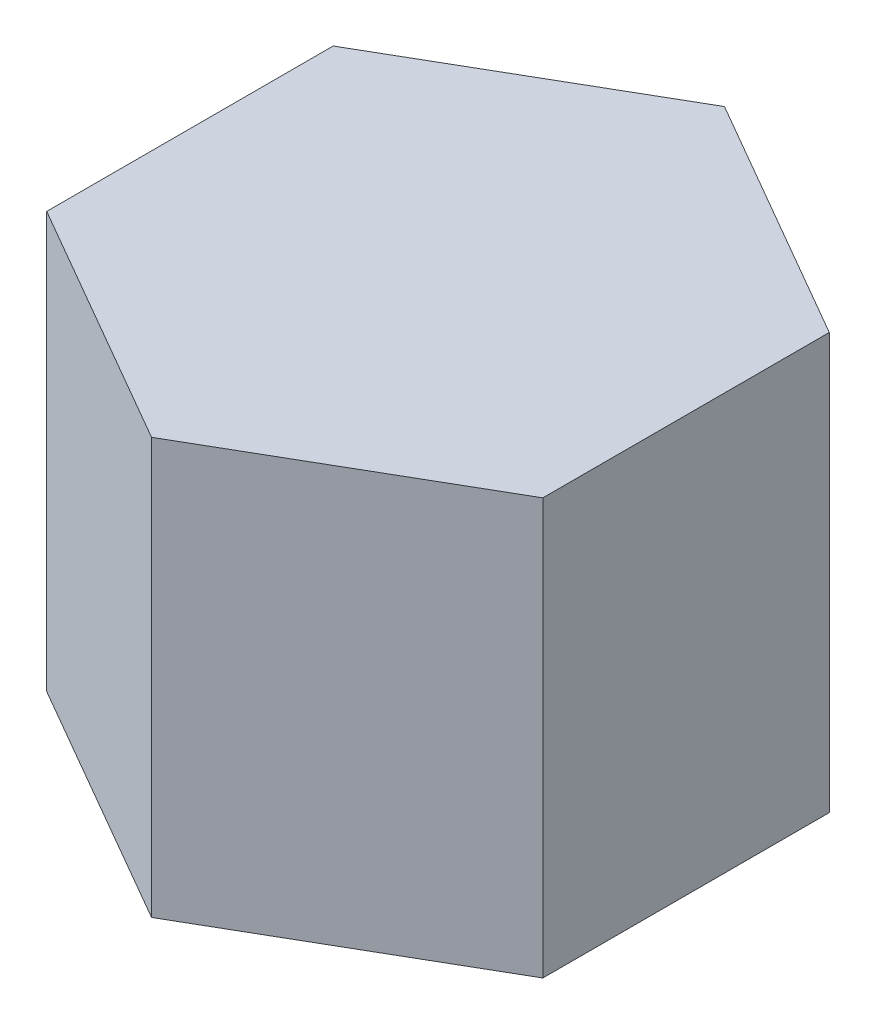
ISO-10303-21;
HEADER;
FILE_DESCRIPTION(('STEP AP214'),'2;1');
FILE_NAME('part.step','',(''),(''),'','','');
FILE_SCHEMA(('AUTOMOTIVE_DESIGN { 1 0 10303 214 1 1 1 1 }'));
ENDSEC;
DATA;
#1=APPLICATION_CONTEXT('core data for automotive mechanical design processes');
#2=APPLICATION_PROTOCOL_DEFINITION('international standard','automotive_design',2000,#1);
#3=PRODUCT_CONTEXT('',#1,'mechanical');
#4=PRODUCT('Part','Part','',(#3));
#5=PRODUCT_RELATED_PRODUCT_CATEGORY('part','',(#4));
#6=PRODUCT_DEFINITION_FORMATION('','',#4);
#7=PRODUCT_DEFINITION_CONTEXT('part definition',#1,'design');
#8=PRODUCT_DEFINITION('design','',#6,#7);
#9=PRODUCT_DEFINITION_SHAPE('','',#8);
#10=(LENGTH_UNIT() NAMED_UNIT(*) SI_UNIT(.MILLI.,.METRE.));
#11=(NAMED_UNIT(*) PLANE_ANGLE_UNIT() SI_UNIT($,.RADIAN.));
#12=(NAMED_UNIT(*) SI_UNIT($,.STERADIAN.) SOLID_ANGLE_UNIT());
#13=UNCERTAINTY_MEASURE_WITH_UNIT(LENGTH_MEASURE(1.E-05),#10,'distance_accuracy_value','');
#14=(GEOMETRIC_REPRESENTATION_CONTEXT(3) GLOBAL_UNCERTAINTY_ASSIGNED_CONTEXT((#13)) GLOBAL_UNIT_ASSIGNED_CONTEXT((#10,
#11,#12)) REPRESENTATION_CONTEXT('',''));
#15=CARTESIAN_POINT('',(0.,0.,0.));
#16=DIRECTION('',(0.,0.,1.));
#17=DIRECTION('',(1.,0.,0.));
#18=AXIS2_PLACEMENT_3D('',#15,#16,#17);
#19=CARTESIAN_POINT('',(211.142660308706,-148.537700895744,290.64094581671));
#20=DIRECTION('',(-0.499999999999943,0.,-0.866025403784472));
#21=DIRECTION('',(-0.866025403784472,0.,0.499999999999943));
#22=AXIS2_PLACEMENT_3D('',#19,#20,#21);
#23=PLANE('',#22);
#24=CARTESIAN_POINT('',(210.839551417382,-149.045793579175,290.81594581671));
#25=DIRECTION('',(0.866025403784471,0.,-0.499999999999943));
#26=VECTOR('',#25,1.);
#27=LINE('',#24,#26);
#28=CARTESIAN_POINT('',(210.839551417382,-149.045793579175,290.81594581671));
#29=VERTEX_POINT('',#28);
#30=CARTESIAN_POINT('',(211.142660308706,-149.045793579175,290.64094581671));
#31=VERTEX_POINT('',#30);
#32=EDGE_CURVE('E170',#29,#31,#27,.T.);
#33=ORIENTED_EDGE('',*,*,#32,.T.);
#34=CARTESIAN_POINT('',(211.142660308706,-148.537700895744,290.64094581671));
#35=DIRECTION('',(0.,-1.,0.));
#36=VECTOR('',#35,1.);
#37=LINE('',#34,#36);
#38=CARTESIAN_POINT('',(211.142660308706,-148.537700895744,290.64094581671));
#39=VERTEX_POINT('',#38);
#40=EDGE_CURVE('E35',#39,#31,#37,.T.);
#41=ORIENTED_EDGE('',*,*,#40,.F.);
#42=CARTESIAN_POINT('',(210.839551417382,-148.537700895744,290.81594581671));
#43=DIRECTION('',(0.866025403784471,0.,-0.499999999999943));
#44=VECTOR('',#43,1.);
#45=LINE('',#42,#44);
#46=CARTESIAN_POINT('',(210.839551417382,-148.537700895744,290.81594581671));
#47=VERTEX_POINT('',#46);
#48=EDGE_CURVE('E159',#47,#39,#45,.T.);
#49=ORIENTED_EDGE('',*,*,#48,.F.);
#50=CARTESIAN_POINT('',(210.839551417382,-148.537700895744,290.81594581671));
#51=DIRECTION('',(0.,-1.,0.));
#52=VECTOR('',#51,1.);
#53=LINE('',#50,#52);
#54=EDGE_CURVE('E10',#47,#29,#53,.T.);
#55=ORIENTED_EDGE('',*,*,#54,.T.);
#56=EDGE_LOOP('',(#33,#41,#49,#55));
#57=FACE_BOUND('',#56,.T.);
#58=ADVANCED_FACE('F16',(#57),#23,.F.);
#59=CARTESIAN_POINT('',(210.839551417382,-148.537700895744,290.81594581671));
#60=DIRECTION('',(0.500000000000062,0.,-0.866025403784403));
#61=DIRECTION('',(-0.866025403784403,0.,-0.500000000000062));
#62=AXIS2_PLACEMENT_3D('',#59,#60,#61);
#63=PLANE('',#62);
#64=CARTESIAN_POINT('',(210.536442526057,-149.045793579175,290.64094581671));
#65=DIRECTION('',(0.866025403784403,0.,0.500000000000062));
#66=VECTOR('',#65,1.);
#67=LINE('',#64,#66);
#68=CARTESIAN_POINT('',(210.536442526057,-149.045793579175,290.64094581671));
#69=VERTEX_POINT('',#68);
#70=EDGE_CURVE('E167',#69,#29,#67,.T.);
#71=ORIENTED_EDGE('',*,*,#70,.T.);
#72=ORIENTED_EDGE('',*,*,#54,.F.);
#73=CARTESIAN_POINT('',(210.536442526057,-148.537700895744,290.64094581671));
#74=DIRECTION('',(0.866025403784403,0.,0.500000000000062));
#75=VECTOR('',#74,1.);
#76=LINE('',#73,#75);
#77=CARTESIAN_POINT('',(210.536442526057,-148.537700895744,290.64094581671));
#78=VERTEX_POINT('',#77);
#79=EDGE_CURVE('E156',#78,#47,#76,.T.);
#80=ORIENTED_EDGE('',*,*,#79,.F.);
#81=CARTESIAN_POINT('',(210.536442526057,-148.537700895744,290.64094581671));
#82=DIRECTION('',(0.,-1.,0.));
#83=VECTOR('',#82,1.);
#84=LINE('',#81,#83);
#85=EDGE_CURVE('E27',#78,#69,#84,.T.);
#86=ORIENTED_EDGE('',*,*,#85,.T.);
#87=EDGE_LOOP('',(#71,#72,#80,#86));
#88=FACE_BOUND('',#87,.T.);
#89=ADVANCED_FACE('F189',(#88),#63,.F.);
#90=CARTESIAN_POINT('',(210.536442526057,-148.537700895744,290.831971220494));
#91=DIRECTION('',(1.,0.,0.));
#92=DIRECTION('',(0.,1.,0.));
#93=AXIS2_PLACEMENT_3D('',#90,#91,#92);
#94=PLANE('',#93);
#95=CARTESIAN_POINT('',(210.536442526057,-149.045793579175,290.29094581671));
#96=DIRECTION('',(0.,0.,1.));
#97=VECTOR('',#96,1.);
#98=LINE('',#95,#97);
#99=CARTESIAN_POINT('',(210.536442526057,-149.045793579175,290.29094581671));
#100=VERTEX_POINT('',#99);
#101=EDGE_CURVE('E163',#100,#69,#98,.T.);
#102=ORIENTED_EDGE('',*,*,#101,.T.);
#103=ORIENTED_EDGE('',*,*,#85,.F.);
#104=CARTESIAN_POINT('',(210.536442526057,-148.537700895744,290.29094581671));
#105=DIRECTION('',(0.,0.,1.));
#106=VECTOR('',#105,1.);
#107=LINE('',#104,#106);
#108=CARTESIAN_POINT('',(210.536442526057,-148.537700895744,290.29094581671));
#109=VERTEX_POINT('',#108);
#110=EDGE_CURVE('E106',#109,#78,#107,.T.);
#111=ORIENTED_EDGE('',*,*,#110,.F.);
#112=CARTESIAN_POINT('',(210.536442526057,-148.537700895744,290.29094581671));
#113=DIRECTION('',(0.,-1.,0.));
#114=VECTOR('',#113,1.);
#115=LINE('',#112,#114);
#116=EDGE_CURVE('E94',#109,#100,#115,.T.);
#117=ORIENTED_EDGE('',*,*,#116,.T.);
#118=EDGE_LOOP('',(#102,#103,#111,#117));
#119=FACE_BOUND('',#118,.T.);
#120=ADVANCED_FACE('F198',(#119),#94,.F.);
#121=CARTESIAN_POINT('',(210.536442526057,-148.537700895744,290.29094581671));
#122=DIRECTION('',(0.499999999999943,0.,0.866025403784472));
#123=DIRECTION('',(0.866025403784472,0.,-0.499999999999943));
#124=AXIS2_PLACEMENT_3D('',#121,#122,#123);
#125=PLANE('',#124);
#126=CARTESIAN_POINT('',(210.839551417382,-149.045793579175,290.11594581671));
#127=DIRECTION('',(-0.866025403784471,0.,0.499999999999943));
#128=VECTOR('',#127,1.);
#129=LINE('',#126,#128);
#130=CARTESIAN_POINT('',(210.839551417382,-149.045793579175,290.11594581671));
#131=VERTEX_POINT('',#130);
#132=EDGE_CURVE('E162',#131,#100,#129,.T.);
#133=ORIENTED_EDGE('',*,*,#132,.T.);
#134=ORIENTED_EDGE('',*,*,#116,.F.);
#135=CARTESIAN_POINT('',(210.839551417382,-148.537700895744,290.11594581671));
#136=DIRECTION('',(-0.866025403784471,0.,0.499999999999943));
#137=VECTOR('',#136,1.);
#138=LINE('',#135,#137);
#139=CARTESIAN_POINT('',(210.839551417382,-148.537700895744,290.11594581671));
#140=VERTEX_POINT('',#139);
#141=EDGE_CURVE('E98',#140,#109,#138,.T.);
#142=ORIENTED_EDGE('',*,*,#141,.F.);
#143=CARTESIAN_POINT('',(210.839551417382,-148.537700895744,290.11594581671));
#144=DIRECTION('',(0.,-1.,0.));
#145=VECTOR('',#144,1.);
#146=LINE('',#143,#145);
#147=EDGE_CURVE('E79',#140,#131,#146,.T.);
#148=ORIENTED_EDGE('',*,*,#147,.T.);
#149=EDGE_LOOP('',(#133,#134,#142,#148));
#150=FACE_BOUND('',#149,.T.);
#151=ADVANCED_FACE('F100',(#150),#125,.F.);
#152=CARTESIAN_POINT('',(210.839551417382,-148.537700895744,290.11594581671));
#153=DIRECTION('',(-0.500000000000062,0.,0.866025403784403));
#154=DIRECTION('',(0.866025403784403,0.,0.500000000000062));
#155=AXIS2_PLACEMENT_3D('',#152,#153,#154);
#156=PLANE('',#155);
#157=CARTESIAN_POINT('',(211.142660308706,-149.045793579175,290.29094581671));
#158=DIRECTION('',(-0.866025403784403,0.,-0.500000000000062));
#159=VECTOR('',#158,1.);
#160=LINE('',#157,#159);
#161=CARTESIAN_POINT('',(211.142660308706,-149.045793579175,290.29094581671));
#162=VERTEX_POINT('',#161);
#163=EDGE_CURVE('E88',#162,#131,#160,.T.);
#164=ORIENTED_EDGE('',*,*,#163,.T.);
#165=ORIENTED_EDGE('',*,*,#147,.F.);
#166=CARTESIAN_POINT('',(211.142660308706,-148.537700895744,290.29094581671));
#167=DIRECTION('',(-0.866025403784403,0.,-0.500000000000062));
#168=VECTOR('',#167,1.);
#169=LINE('',#166,#168);
#170=CARTESIAN_POINT('',(211.142660308706,-148.537700895744,290.29094581671));
#171=VERTEX_POINT('',#170);
#172=EDGE_CURVE('E84',#171,#140,#169,.T.);
#173=ORIENTED_EDGE('',*,*,#172,.F.);
#174=CARTESIAN_POINT('',(211.142660308706,-148.537700895744,290.29094581671));
#175=DIRECTION('',(0.,-1.,0.));
#176=VECTOR('',#175,1.);
#177=LINE('',#174,#176);
#178=EDGE_CURVE('E58',#171,#162,#177,.T.);
#179=ORIENTED_EDGE('',*,*,#178,.T.);
#180=EDGE_LOOP('',(#164,#165,#173,#179));
#181=FACE_BOUND('',#180,.T.);
#182=ADVANCED_FACE('F82',(#181),#156,.F.);
#183=CARTESIAN_POINT('',(211.142660308706,-148.537700895744,290.831971220494));
#184=DIRECTION('',(-1.,0.,0.));
#185=DIRECTION('',(0.,-1.,0.));
#186=AXIS2_PLACEMENT_3D('',#183,#184,#185);
#187=PLANE('',#186);
#188=CARTESIAN_POINT('',(211.142660308706,-149.045793579175,290.64094581671));
#189=DIRECTION('',(0.,0.,-1.));
#190=VECTOR('',#189,1.);
#191=LINE('',#188,#190);
#192=EDGE_CURVE('E160',#31,#162,#191,.T.);
#193=ORIENTED_EDGE('',*,*,#192,.T.);
#194=ORIENTED_EDGE('',*,*,#178,.F.);
#195=CARTESIAN_POINT('',(211.142660308706,-148.537700895744,290.64094581671));
#196=DIRECTION('',(0.,0.,-1.));
#197=VECTOR('',#196,1.);
#198=LINE('',#195,#197);
#199=EDGE_CURVE('E112',#39,#171,#198,.T.);
#200=ORIENTED_EDGE('',*,*,#199,.F.);
#201=ORIENTED_EDGE('',*,*,#40,.T.);
#202=EDGE_LOOP('',(#193,#194,#200,#201));
#203=FACE_BOUND('',#202,.T.);
#204=ADVANCED_FACE('F131',(#203),#187,.F.);
#205=CARTESIAN_POINT('',(206.339551417382,-148.537700895744,290.831971220494));
#206=DIRECTION('',(0.,-1.,0.));
#207=DIRECTION('',(1.,0.,0.));
#208=AXIS2_PLACEMENT_3D('',#205,#206,#207);
#209=PLANE('',#208);
#210=ORIENTED_EDGE('',*,*,#48,.T.);
#211=ORIENTED_EDGE('',*,*,#199,.T.);
#212=ORIENTED_EDGE('',*,*,#172,.T.);
#213=ORIENTED_EDGE('',*,*,#141,.T.);
#214=ORIENTED_EDGE('',*,*,#110,.T.);
#215=ORIENTED_EDGE('',*,*,#79,.T.);
#216=EDGE_LOOP('',(#210,#211,#212,#213,#214,#215));
#217=FACE_BOUND('',#216,.T.);
#218=ADVANCED_FACE('F111',(#217),#209,.F.);
#219=CARTESIAN_POINT('',(206.339551417382,-149.045793579175,290.831971220494));
#220=DIRECTION('',(0.,-1.,0.));
#221=DIRECTION('',(1.,0.,0.));
#222=AXIS2_PLACEMENT_3D('',#219,#220,#221);
#223=PLANE('',#222);
#224=ORIENTED_EDGE('',*,*,#32,.F.);
#225=ORIENTED_EDGE('',*,*,#70,.F.);
#226=ORIENTED_EDGE('',*,*,#101,.F.);
#227=ORIENTED_EDGE('',*,*,#132,.F.);
#228=ORIENTED_EDGE('',*,*,#163,.F.);
#229=ORIENTED_EDGE('',*,*,#192,.F.);
#230=EDGE_LOOP('',(#224,#225,#226,#227,#228,#229));
#231=FACE_BOUND('',#230,.T.);
#232=ADVANCED_FACE('F130',(#231),#223,.T.);
#233=CLOSED_SHELL('',(#58,#89,#120,#151,#182,#204,#218,#232));
#234=MANIFOLD_SOLID_BREP('B1',#233);
#235=ADVANCED_BREP_SHAPE_REPRESENTATION('',(#18,#234),#14);
#236=SHAPE_DEFINITION_REPRESENTATION(#9,#235);
ENDSEC;
END-ISO-10303-21;
